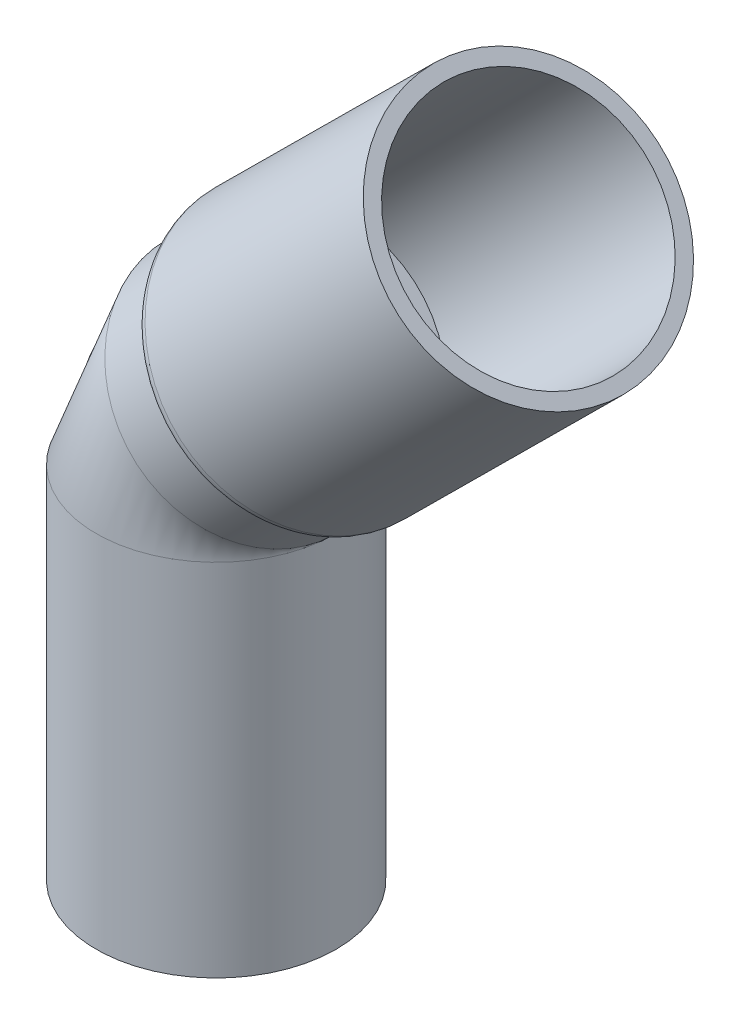
ISO-10303-21;
HEADER;
FILE_DESCRIPTION(('STEP AP214'),'2;1');
FILE_NAME('part.step','',(''),(''),'','','');
FILE_SCHEMA(('AUTOMOTIVE_DESIGN { 1 0 10303 214 1 1 1 1 }'));
ENDSEC;
DATA;
#1=APPLICATION_CONTEXT('core data for automotive mechanical design processes');
#2=APPLICATION_PROTOCOL_DEFINITION('international standard','automotive_design',2000,#1);
#3=PRODUCT_CONTEXT('',#1,'mechanical');
#4=PRODUCT('Part','Part','',(#3));
#5=PRODUCT_RELATED_PRODUCT_CATEGORY('part','',(#4));
#6=PRODUCT_DEFINITION_FORMATION('','',#4);
#7=PRODUCT_DEFINITION_CONTEXT('part definition',#1,'design');
#8=PRODUCT_DEFINITION('design','',#6,#7);
#9=PRODUCT_DEFINITION_SHAPE('','',#8);
#10=(LENGTH_UNIT() NAMED_UNIT(*) SI_UNIT(.MILLI.,.METRE.));
#11=(NAMED_UNIT(*) PLANE_ANGLE_UNIT() SI_UNIT($,.RADIAN.));
#12=(NAMED_UNIT(*) SI_UNIT($,.STERADIAN.) SOLID_ANGLE_UNIT());
#13=UNCERTAINTY_MEASURE_WITH_UNIT(LENGTH_MEASURE(1.E-05),#10,'distance_accuracy_value','');
#14=(GEOMETRIC_REPRESENTATION_CONTEXT(3) GLOBAL_UNCERTAINTY_ASSIGNED_CONTEXT((#13)) GLOBAL_UNIT_ASSIGNED_CONTEXT((#10,
#11,#12)) REPRESENTATION_CONTEXT('',''));
#15=CARTESIAN_POINT('',(0.,0.,0.));
#16=DIRECTION('',(0.,0.,1.));
#17=DIRECTION('',(1.,0.,0.));
#18=AXIS2_PLACEMENT_3D('',#15,#16,#17);
#19=CARTESIAN_POINT('',(29.1414993381229,41.6494395262706,0.));
#20=DIRECTION('',(0.709644860997408,0.704559558348313,0.));
#21=DIRECTION('',(-0.704559558348313,0.709644860997408,0.));
#22=AXIS2_PLACEMENT_3D('',#19,#20,#21);
#23=PLANE('',#22);
#24=CARTESIAN_POINT('',(29.1414993381229,41.6494395262706,0.));
#25=DIRECTION('',(0.709644860997408,0.704559558348313,0.));
#26=DIRECTION('',(-0.704559558348313,0.709644860997408,0.));
#27=AXIS2_PLACEMENT_3D('',#24,#25,#26);
#28=CIRCLE('',#27,18.);
#29=CARTESIAN_POINT('',(16.4594272878533,54.423047024224,0.));
#30=VERTEX_POINT('',#29);
#31=EDGE_CURVE('E75',#30,#30,#28,.T.);
#32=ORIENTED_EDGE('',*,*,#31,.T.);
#33=EDGE_LOOP('',(#32));
#34=FACE_BOUND('',#33,.T.);
#35=CARTESIAN_POINT('',(29.1414993381229,41.6494395262706,0.));
#36=DIRECTION('',(0.709644860997408,0.704559558348313,0.));
#37=DIRECTION('',(-0.704559558348313,0.709644860997408,0.));
#38=AXIS2_PLACEMENT_3D('',#35,#36,#37);
#39=CIRCLE('',#38,16.);
#40=CARTESIAN_POINT('',(17.8685464045499,53.0037573022291,0.));
#41=VERTEX_POINT('',#40);
#42=EDGE_CURVE('E79',#41,#41,#39,.T.);
#43=ORIENTED_EDGE('',*,*,#42,.F.);
#44=EDGE_LOOP('',(#43));
#45=FACE_BOUND('',#44,.T.);
#46=ADVANCED_FACE('F68',(#34,#45),#23,.T.);
#47=CARTESIAN_POINT('',(-1.37322968476564,11.3533785172932,0.));
#48=DIRECTION('',(0.709644860997408,0.704559558348313,0.));
#49=DIRECTION('',(-0.704559558348313,0.709644860997408,0.));
#50=AXIS2_PLACEMENT_3D('',#47,#48,#49);
#51=CYLINDRICAL_SURFACE('',#50,18.);
#52=CARTESIAN_POINT('',(0.0460600372291775,12.7624976339898,0.));
#53=DIRECTION('',(0.709644860997408,0.704559558348313,0.));
#54=DIRECTION('',(-0.704559558348313,0.709644860997408,0.));
#55=AXIS2_PLACEMENT_3D('',#52,#53,#54);
#56=CIRCLE('',#55,18.);
#57=CARTESIAN_POINT('',(-12.6360120130405,25.5361051319431,0.));
#58=VERTEX_POINT('',#57);
#59=EDGE_CURVE('E13',#58,#58,#56,.T.);
#60=ORIENTED_EDGE('',*,*,#59,.T.);
#61=EDGE_LOOP('',(#60));
#62=FACE_BOUND('',#61,.T.);
#63=ORIENTED_EDGE('',*,*,#31,.F.);
#64=EDGE_LOOP('',(#63));
#65=FACE_BOUND('',#64,.T.);
#66=ADVANCED_FACE('F93',(#62,#65),#51,.T.);
#67=CARTESIAN_POINT('',(-1.37322968476564,11.3533785172932,0.));
#68=DIRECTION('',(0.709644860997408,0.704559558348313,0.));
#69=DIRECTION('',(-0.704559558348313,0.709644860997408,0.));
#70=AXIS2_PLACEMENT_3D('',#67,#68,#69);
#71=CYLINDRICAL_SURFACE('',#70,16.);
#72=ORIENTED_EDGE('',*,*,#42,.T.);
#73=EDGE_LOOP('',(#72));
#74=FACE_BOUND('',#73,.T.);
#75=CARTESIAN_POINT('',(-1.37322968476564,11.3533785172932,0.));
#76=DIRECTION('',(0.709644860997408,0.704559558348313,0.));
#77=DIRECTION('',(-0.704559558348313,0.709644860997408,0.));
#78=AXIS2_PLACEMENT_3D('',#75,#76,#77);
#79=CIRCLE('',#78,16.);
#80=CARTESIAN_POINT('',(-12.6461826183386,22.7076962932517,0.));
#81=VERTEX_POINT('',#80);
#82=EDGE_CURVE('E83',#81,#81,#79,.T.);
#83=ORIENTED_EDGE('',*,*,#82,.F.);
#84=EDGE_LOOP('',(#83));
#85=FACE_BOUND('',#84,.T.);
#86=ADVANCED_FACE('F91',(#74,#85),#71,.F.);
#87=CARTESIAN_POINT('',(0.0460600372291793,12.7624976339898,0.));
#88=DIRECTION('',(0.709644860997408,0.704559558348313,0.));
#89=DIRECTION('',(-0.704559558348313,0.709644860997408,0.));
#90=AXIS2_PLACEMENT_3D('',#87,#88,#89);
#91=TOROIDAL_SURFACE('',#90,16.,2.);
#92=ORIENTED_EDGE('',*,*,#82,.T.);
#93=EDGE_LOOP('',(#92));
#94=FACE_BOUND('',#93,.T.);
#95=ORIENTED_EDGE('',*,*,#59,.F.);
#96=EDGE_LOOP('',(#95));
#97=FACE_BOUND('',#96,.T.);
#98=ADVANCED_FACE('F70',(#94,#97),#91,.T.);
#99=CLOSED_SHELL('',(#46,#66,#86,#98));
#100=MANIFOLD_SOLID_BREP('B2',#99);
#101=CARTESIAN_POINT('',(-12.4870805001693,-54.3419752838002,0.));
#102=DIRECTION('',(0.,-1.,0.));
#103=DIRECTION('',(1.,0.,0.));
#104=AXIS2_PLACEMENT_3D('',#101,#102,#103);
#105=PLANE('',#104);
#106=CARTESIAN_POINT('',(-12.4870805001693,-54.3419752838002,0.));
#107=DIRECTION('',(0.,-1.,0.));
#108=DIRECTION('',(1.,0.,0.));
#109=AXIS2_PLACEMENT_3D('',#106,#107,#108);
#110=CIRCLE('',#109,16.);
#111=CARTESIAN_POINT('',(3.5129194998307,-54.3419752838002,0.));
#112=VERTEX_POINT('',#111);
#113=EDGE_CURVE('E137',#112,#112,#110,.T.);
#114=ORIENTED_EDGE('',*,*,#113,.T.);
#115=EDGE_LOOP('',(#114));
#116=FACE_BOUND('',#115,.T.);
#117=CARTESIAN_POINT('',(-12.4870805001693,-54.3419752838002,0.));
#118=DIRECTION('',(0.,-1.,0.));
#119=DIRECTION('',(1.,0.,0.));
#120=AXIS2_PLACEMENT_3D('',#117,#118,#119);
#121=CIRCLE('',#120,14.);
#122=CARTESIAN_POINT('',(1.5129194998307,-54.3419752838002,0.));
#123=VERTEX_POINT('',#122);
#124=EDGE_CURVE('E161',#123,#123,#121,.T.);
#125=ORIENTED_EDGE('',*,*,#124,.F.);
#126=EDGE_LOOP('',(#125));
#127=FACE_BOUND('',#126,.T.);
#128=ADVANCED_FACE('F129',(#116,#127),#105,.T.);
#129=CARTESIAN_POINT('',(-12.4870805001693,-54.3419752838002,0.));
#130=DIRECTION('',(0.,1.,0.));
#131=DIRECTION('',(0.,0.,1.));
#132=AXIS2_PLACEMENT_3D('',#129,#130,#131);
#133=CYLINDRICAL_SURFACE('',#132,16.);
#134=CARTESIAN_POINT('',(-12.4870805001693,-6.34197528380018,0.));
#135=DIRECTION('',(0.,1.,0.));
#136=DIRECTION('',(0.,0.,1.));
#137=AXIS2_PLACEMENT_3D('',#134,#135,#136);
#138=CIRCLE('',#137,16.);
#139=CARTESIAN_POINT('',(3.5129194998307,-6.34197528380018,0.));
#140=VERTEX_POINT('',#139);
#141=EDGE_CURVE('E66',#140,#140,#138,.F.);
#142=ORIENTED_EDGE('',*,*,#141,.T.);
#143=EDGE_LOOP('',(#142));
#144=FACE_BOUND('',#143,.T.);
#145=ORIENTED_EDGE('',*,*,#113,.F.);
#146=EDGE_LOOP('',(#145));
#147=FACE_BOUND('',#146,.T.);
#148=ADVANCED_FACE('F149',(#144,#147),#133,.T.);
#149=CARTESIAN_POINT('',(3.5129194998307,-6.34197528380018,0.));
#150=DIRECTION('',(0.,0.,-1.));
#151=DIRECTION('',(-1.,0.,0.));
#152=AXIS2_PLACEMENT_3D('',#149,#150,#151);
#153=TOROIDAL_SURFACE('',#152,16.,16.);
#154=CARTESIAN_POINT('',(-7.7600334337423,5.01234249215834,0.));
#155=DIRECTION('',(0.709644860997407,0.704559558348314,0.));
#156=DIRECTION('',(-0.704559558348314,0.709644860997407,0.));
#157=AXIS2_PLACEMENT_3D('',#154,#155,#156);
#158=CIRCLE('',#157,16.);
#159=EDGE_CURVE('E141',#140,#140,#158,.T.);
#160=ORIENTED_EDGE('',*,*,#159,.F.);
#161=ORIENTED_EDGE('',*,*,#141,.F.);
#162=EDGE_LOOP('',(#160,#161));
#163=FACE_BOUND('',#162,.T.);
#164=ADVANCED_FACE('F131',(#163),#153,.T.);
#165=CARTESIAN_POINT('',(-12.4870805001693,-54.3419752838002,0.));
#166=DIRECTION('',(0.,1.,0.));
#167=DIRECTION('',(0.,0.,1.));
#168=AXIS2_PLACEMENT_3D('',#165,#166,#167);
#169=CYLINDRICAL_SURFACE('',#168,14.);
#170=CARTESIAN_POINT('',(-12.4870805001693,-6.34197528380018,0.));
#171=DIRECTION('',(0.,1.,0.));
#172=DIRECTION('',(0.,0.,1.));
#173=AXIS2_PLACEMENT_3D('',#170,#171,#172);
#174=CIRCLE('',#173,14.);
#175=CARTESIAN_POINT('',(-26.4870805001693,-6.34197528380018,0.));
#176=VERTEX_POINT('',#175);
#177=EDGE_CURVE('E158',#176,#176,#174,.F.);
#178=ORIENTED_EDGE('',*,*,#177,.F.);
#179=EDGE_LOOP('',(#178));
#180=FACE_BOUND('',#179,.T.);
#181=ORIENTED_EDGE('',*,*,#124,.T.);
#182=EDGE_LOOP('',(#181));
#183=FACE_BOUND('',#182,.T.);
#184=ADVANCED_FACE('F187',(#180,#183),#169,.F.);
#185=CARTESIAN_POINT('',(3.5129194998307,-6.34197528380018,0.));
#186=DIRECTION('',(0.,0.,-1.));
#187=DIRECTION('',(-1.,0.,0.));
#188=AXIS2_PLACEMENT_3D('',#185,#186,#187);
#189=TOROIDAL_SURFACE('',#188,16.,14.);
#190=CARTESIAN_POINT('',(-7.76003343374231,5.01234249215835,0.));
#191=DIRECTION('',(-0.709644860997408,-0.704559558348313,0.));
#192=DIRECTION('',(0.704559558348313,-0.709644860997408,0.));
#193=AXIS2_PLACEMENT_3D('',#190,#191,#192);
#194=CIRCLE('',#193,14.);
#195=CARTESIAN_POINT('',(-17.6238672506187,14.9473705461221,0.));
#196=VERTEX_POINT('',#195);
#197=EDGE_CURVE('E155',#196,#196,#194,.T.);
#198=CARTESIAN_POINT('',(3.5129194998307,-6.34197528380018,0.));
#199=DIRECTION('',(0.,0.,-1.));
#200=DIRECTION('',(-1.,0.,0.));
#201=AXIS2_PLACEMENT_3D('',#198,#199,#200);
#202=CIRCLE('',#201,30.);
#203=EDGE_CURVE('',#176,#196,#202,.T.);
#204=ORIENTED_EDGE('',*,*,#177,.T.);
#205=ORIENTED_EDGE('',*,*,#197,.F.);
#206=ORIENTED_EDGE('',*,*,#203,.T.);
#207=ORIENTED_EDGE('',*,*,#203,.F.);
#208=EDGE_LOOP('',(#204,#206,#205,#207));
#209=FACE_BOUND('',#208,.T.);
#210=ADVANCED_FACE('F178',(#209),#189,.F.);
#211=CARTESIAN_POINT('',(-1.37322968476564,11.3533785172932,0.));
#212=DIRECTION('',(0.709644860997407,0.704559558348314,0.));
#213=DIRECTION('',(-0.704559558348314,0.709644860997407,0.));
#214=AXIS2_PLACEMENT_3D('',#211,#212,#213);
#215=PLANE('',#214);
#216=CARTESIAN_POINT('',(-1.37322968476564,11.3533785172932,0.));
#217=DIRECTION('',(0.709644860997407,0.704559558348314,0.));
#218=DIRECTION('',(-0.704559558348314,0.709644860997407,0.));
#219=AXIS2_PLACEMENT_3D('',#216,#217,#218);
#220=CIRCLE('',#219,16.);
#221=CARTESIAN_POINT('',(-12.6461826183387,22.7076962932517,0.));
#222=VERTEX_POINT('',#221);
#223=EDGE_CURVE('E145',#222,#222,#220,.T.);
#224=ORIENTED_EDGE('',*,*,#223,.T.);
#225=EDGE_LOOP('',(#224));
#226=FACE_BOUND('',#225,.T.);
#227=CARTESIAN_POINT('',(-1.37322968476564,11.3533785172932,0.));
#228=DIRECTION('',(0.709644860997407,0.704559558348314,0.));
#229=DIRECTION('',(-0.704559558348314,0.709644860997407,0.));
#230=AXIS2_PLACEMENT_3D('',#227,#228,#229);
#231=CIRCLE('',#230,14.);
#232=CARTESIAN_POINT('',(-11.237063501642,21.2884065712569,0.));
#233=VERTEX_POINT('',#232);
#234=EDGE_CURVE('E146',#233,#233,#231,.T.);
#235=ORIENTED_EDGE('',*,*,#234,.F.);
#236=EDGE_LOOP('',(#235));
#237=FACE_BOUND('',#236,.T.);
#238=ADVANCED_FACE('F176',(#226,#237),#215,.T.);
#239=CARTESIAN_POINT('',(-7.7600334337423,5.01234249215834,0.));
#240=DIRECTION('',(0.709644860997407,0.704559558348314,0.));
#241=DIRECTION('',(-0.704559558348314,0.709644860997407,0.));
#242=AXIS2_PLACEMENT_3D('',#239,#240,#241);
#243=CYLINDRICAL_SURFACE('',#242,16.);
#244=ORIENTED_EDGE('',*,*,#223,.F.);
#245=EDGE_LOOP('',(#244));
#246=FACE_BOUND('',#245,.T.);
#247=ORIENTED_EDGE('',*,*,#159,.T.);
#248=EDGE_LOOP('',(#247));
#249=FACE_BOUND('',#248,.T.);
#250=ADVANCED_FACE('F143',(#246,#249),#243,.T.);
#251=CARTESIAN_POINT('',(-7.7600334337423,5.01234249215834,0.));
#252=DIRECTION('',(0.709644860997407,0.704559558348314,0.));
#253=DIRECTION('',(-0.704559558348314,0.709644860997407,0.));
#254=AXIS2_PLACEMENT_3D('',#251,#252,#253);
#255=CYLINDRICAL_SURFACE('',#254,14.);
#256=ORIENTED_EDGE('',*,*,#234,.T.);
#257=EDGE_LOOP('',(#256));
#258=FACE_BOUND('',#257,.T.);
#259=ORIENTED_EDGE('',*,*,#197,.T.);
#260=EDGE_LOOP('',(#259));
#261=FACE_BOUND('',#260,.T.);
#262=ADVANCED_FACE('F173',(#258,#261),#255,.F.);
#263=CLOSED_SHELL('',(#128,#148,#164,#184,#210,#238,#250,#262));
#264=MANIFOLD_SOLID_BREP('B8',#263);
#265=ADVANCED_BREP_SHAPE_REPRESENTATION('',(#18,#100,#264),#14);
#266=SHAPE_DEFINITION_REPRESENTATION(#9,#265);
ENDSEC;
END-ISO-10303-21;
